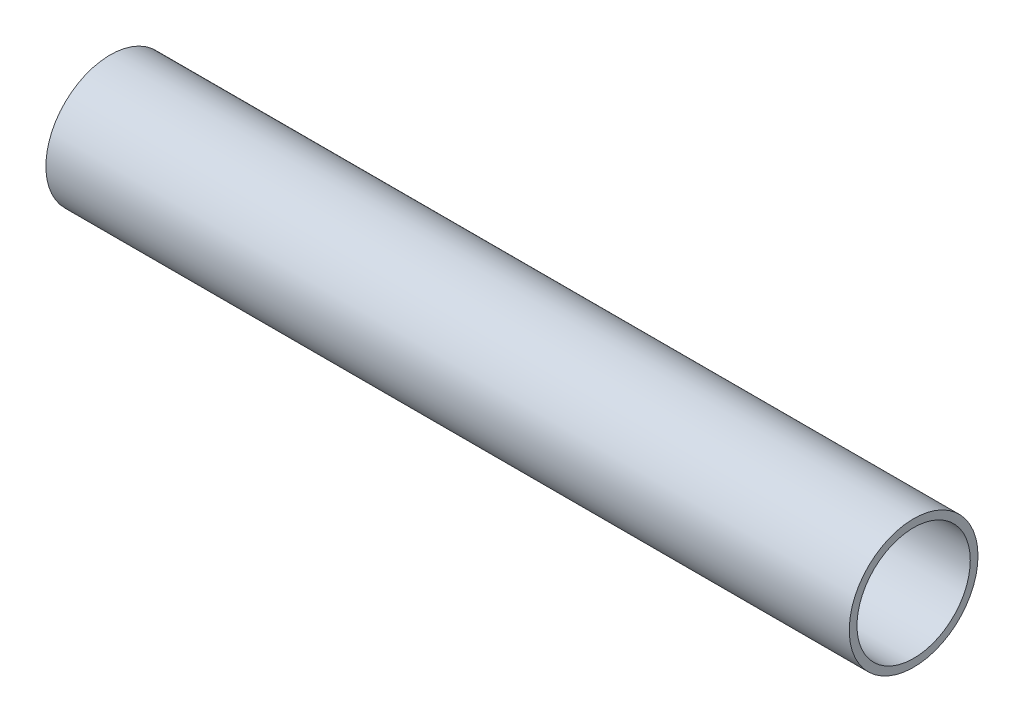
ISO-10303-21;
HEADER;
FILE_DESCRIPTION(('STEP AP214'),'2;1');
FILE_NAME('part.step','',(''),(''),'','','');
FILE_SCHEMA(('AUTOMOTIVE_DESIGN { 1 0 10303 214 1 1 1 1 }'));
ENDSEC;
DATA;
#1=APPLICATION_CONTEXT('core data for automotive mechanical design processes');
#2=APPLICATION_PROTOCOL_DEFINITION('international standard','automotive_design',2000,#1);
#3=PRODUCT_CONTEXT('',#1,'mechanical');
#4=PRODUCT('Part','Part','',(#3));
#5=PRODUCT_RELATED_PRODUCT_CATEGORY('part','',(#4));
#6=PRODUCT_DEFINITION_FORMATION('','',#4);
#7=PRODUCT_DEFINITION_CONTEXT('part definition',#1,'design');
#8=PRODUCT_DEFINITION('design','',#6,#7);
#9=PRODUCT_DEFINITION_SHAPE('','',#8);
#10=(LENGTH_UNIT() NAMED_UNIT(*) SI_UNIT(.MILLI.,.METRE.));
#11=(NAMED_UNIT(*) PLANE_ANGLE_UNIT() SI_UNIT($,.RADIAN.));
#12=(NAMED_UNIT(*) SI_UNIT($,.STERADIAN.) SOLID_ANGLE_UNIT());
#13=UNCERTAINTY_MEASURE_WITH_UNIT(LENGTH_MEASURE(1.E-05),#10,'distance_accuracy_value','');
#14=(GEOMETRIC_REPRESENTATION_CONTEXT(3) GLOBAL_UNCERTAINTY_ASSIGNED_CONTEXT((#13)) GLOBAL_UNIT_ASSIGNED_CONTEXT((#10,
#11,#12)) REPRESENTATION_CONTEXT('',''));
#15=CARTESIAN_POINT('',(0.,0.,0.));
#16=DIRECTION('',(0.,0.,1.));
#17=DIRECTION('',(1.,0.,0.));
#18=AXIS2_PLACEMENT_3D('',#15,#16,#17);
#19=CARTESIAN_POINT('',(156.,0.,0.));
#20=DIRECTION('',(1.,0.,0.));
#21=DIRECTION('',(0.,0.,-1.));
#22=AXIS2_PLACEMENT_3D('',#19,#20,#21);
#23=PLANE('',#22);
#24=CARTESIAN_POINT('',(156.,0.,0.));
#25=DIRECTION('',(1.,0.,0.));
#26=DIRECTION('',(0.,0.,-1.));
#27=AXIS2_PLACEMENT_3D('',#24,#25,#26);
#28=CIRCLE('',#27,12.5);
#29=CARTESIAN_POINT('',(156.,0.,-12.5));
#30=VERTEX_POINT('',#29);
#31=EDGE_CURVE('E10',#30,#30,#28,.T.);
#32=ORIENTED_EDGE('',*,*,#31,.T.);
#33=EDGE_LOOP('',(#32));
#34=FACE_BOUND('',#33,.T.);
#35=CARTESIAN_POINT('',(156.,0.,0.));
#36=DIRECTION('',(1.,0.,0.));
#37=DIRECTION('',(0.,0.,-1.));
#38=AXIS2_PLACEMENT_3D('',#35,#36,#37);
#39=CIRCLE('',#38,11.);
#40=CARTESIAN_POINT('',(156.,0.,-11.));
#41=VERTEX_POINT('',#40);
#42=EDGE_CURVE('E41',#41,#41,#39,.T.);
#43=ORIENTED_EDGE('',*,*,#42,.F.);
#44=EDGE_LOOP('',(#43));
#45=FACE_BOUND('',#44,.T.);
#46=ADVANCED_FACE('F30',(#34,#45),#23,.T.);
#47=CARTESIAN_POINT('',(0.,0.,0.));
#48=DIRECTION('',(1.,0.,0.));
#49=DIRECTION('',(0.,0.,-1.));
#50=AXIS2_PLACEMENT_3D('',#47,#48,#49);
#51=PLANE('',#50);
#52=CARTESIAN_POINT('',(0.,0.,0.));
#53=DIRECTION('',(1.,0.,0.));
#54=DIRECTION('',(0.,0.,-1.));
#55=AXIS2_PLACEMENT_3D('',#52,#53,#54);
#56=CIRCLE('',#55,12.5);
#57=CARTESIAN_POINT('',(0.,0.,-12.5));
#58=VERTEX_POINT('',#57);
#59=EDGE_CURVE('E34',#58,#58,#56,.T.);
#60=ORIENTED_EDGE('',*,*,#59,.F.);
#61=EDGE_LOOP('',(#60));
#62=FACE_BOUND('',#61,.T.);
#63=CARTESIAN_POINT('',(0.,0.,0.));
#64=DIRECTION('',(1.,0.,0.));
#65=DIRECTION('',(0.,0.,-1.));
#66=AXIS2_PLACEMENT_3D('',#63,#64,#65);
#67=CIRCLE('',#66,11.);
#68=CARTESIAN_POINT('',(0.,0.,-11.));
#69=VERTEX_POINT('',#68);
#70=EDGE_CURVE('E43',#69,#69,#67,.T.);
#71=ORIENTED_EDGE('',*,*,#70,.T.);
#72=EDGE_LOOP('',(#71));
#73=FACE_BOUND('',#72,.T.);
#74=ADVANCED_FACE('F53',(#62,#73),#51,.F.);
#75=CARTESIAN_POINT('',(156.,0.,0.));
#76=DIRECTION('',(-1.,0.,0.));
#77=DIRECTION('',(0.,0.,1.));
#78=AXIS2_PLACEMENT_3D('',#75,#76,#77);
#79=CYLINDRICAL_SURFACE('',#78,12.5);
#80=ORIENTED_EDGE('',*,*,#31,.F.);
#81=EDGE_LOOP('',(#80));
#82=FACE_BOUND('',#81,.T.);
#83=ORIENTED_EDGE('',*,*,#59,.T.);
#84=EDGE_LOOP('',(#83));
#85=FACE_BOUND('',#84,.T.);
#86=ADVANCED_FACE('F32',(#82,#85),#79,.T.);
#87=CARTESIAN_POINT('',(156.,0.,0.));
#88=DIRECTION('',(-1.,0.,0.));
#89=DIRECTION('',(0.,0.,1.));
#90=AXIS2_PLACEMENT_3D('',#87,#88,#89);
#91=CYLINDRICAL_SURFACE('',#90,11.);
#92=ORIENTED_EDGE('',*,*,#42,.T.);
#93=EDGE_LOOP('',(#92));
#94=FACE_BOUND('',#93,.T.);
#95=ORIENTED_EDGE('',*,*,#70,.F.);
#96=EDGE_LOOP('',(#95));
#97=FACE_BOUND('',#96,.T.);
#98=ADVANCED_FACE('F49',(#94,#97),#91,.F.);
#99=CLOSED_SHELL('',(#46,#74,#86,#98));
#100=MANIFOLD_SOLID_BREP('B2',#99);
#101=ADVANCED_BREP_SHAPE_REPRESENTATION('',(#18,#100),#14);
#102=SHAPE_DEFINITION_REPRESENTATION(#9,#101);
ENDSEC;
END-ISO-10303-21;
